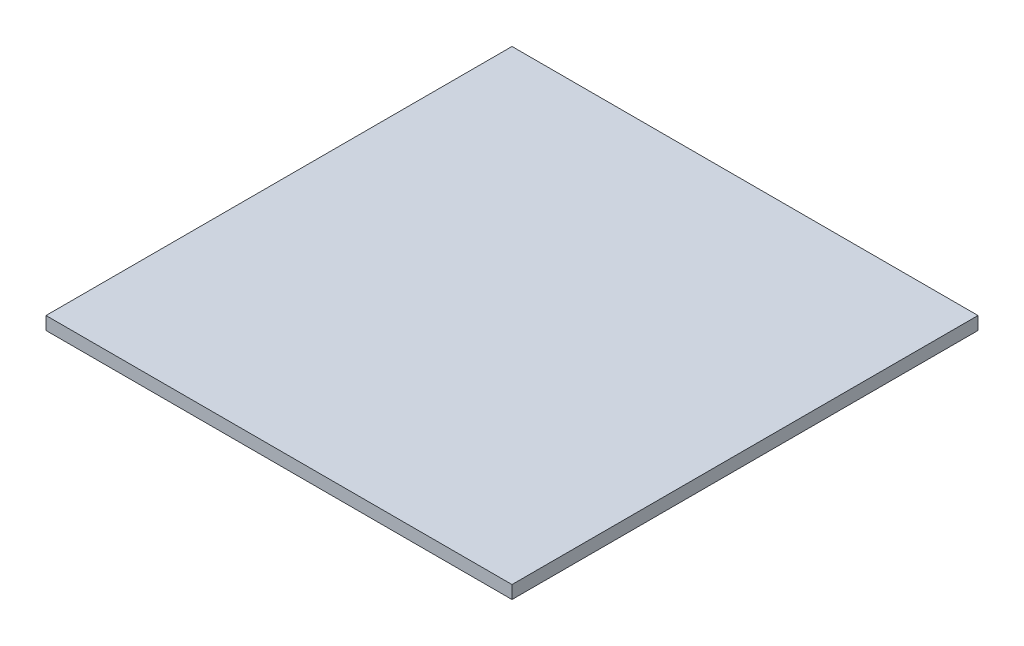
ISO-10303-21;
HEADER;
FILE_DESCRIPTION(('STEP AP214'),'2;1');
FILE_NAME('part.step','',(''),(''),'','','');
FILE_SCHEMA(('AUTOMOTIVE_DESIGN { 1 0 10303 214 1 1 1 1 }'));
ENDSEC;
DATA;
#1=APPLICATION_CONTEXT('core data for automotive mechanical design processes');
#2=APPLICATION_PROTOCOL_DEFINITION('international standard','automotive_design',2000,#1);
#3=PRODUCT_CONTEXT('',#1,'mechanical');
#4=PRODUCT('Part','Part','',(#3));
#5=PRODUCT_RELATED_PRODUCT_CATEGORY('part','',(#4));
#6=PRODUCT_DEFINITION_FORMATION('','',#4);
#7=PRODUCT_DEFINITION_CONTEXT('part definition',#1,'design');
#8=PRODUCT_DEFINITION('design','',#6,#7);
#9=PRODUCT_DEFINITION_SHAPE('','',#8);
#10=(LENGTH_UNIT() NAMED_UNIT(*) SI_UNIT(.MILLI.,.METRE.));
#11=(NAMED_UNIT(*) PLANE_ANGLE_UNIT() SI_UNIT($,.RADIAN.));
#12=(NAMED_UNIT(*) SI_UNIT($,.STERADIAN.) SOLID_ANGLE_UNIT());
#13=UNCERTAINTY_MEASURE_WITH_UNIT(LENGTH_MEASURE(1.E-05),#10,'distance_accuracy_value','');
#14=(GEOMETRIC_REPRESENTATION_CONTEXT(3) GLOBAL_UNCERTAINTY_ASSIGNED_CONTEXT((#13)) GLOBAL_UNIT_ASSIGNED_CONTEXT((#10,
#11,#12)) REPRESENTATION_CONTEXT('',''));
#15=CARTESIAN_POINT('',(0.,0.,0.));
#16=DIRECTION('',(0.,0.,1.));
#17=DIRECTION('',(1.,0.,0.));
#18=AXIS2_PLACEMENT_3D('',#15,#16,#17);
#19=CARTESIAN_POINT('',(33.5,6.,42.2484030110668));
#20=DIRECTION('',(0.,0.,-1.));
#21=DIRECTION('',(-1.,0.,0.));
#22=AXIS2_PLACEMENT_3D('',#19,#20,#21);
#23=PLANE('',#22);
#24=DIRECTION('',(1.,0.,0.));
#25=VECTOR('',#24,1.);
#26=CARTESIAN_POINT('',(33.5,0.,42.2484030110668));
#27=LINE('',#26,#25);
#28=CARTESIAN_POINT('',(-181.5,0.,42.2484030110668));
#29=VERTEX_POINT('',#28);
#30=CARTESIAN_POINT('',(33.5,0.,42.2484030110668));
#31=VERTEX_POINT('',#30);
#32=EDGE_CURVE('E108',#29,#31,#27,.T.);
#33=ORIENTED_EDGE('',*,*,#32,.T.);
#34=DIRECTION('',(0.,-1.,0.));
#35=VECTOR('',#34,1.);
#36=CARTESIAN_POINT('',(33.5,6.,42.2484030110668));
#37=LINE('',#36,#35);
#38=CARTESIAN_POINT('',(33.5,6.,42.2484030110668));
#39=VERTEX_POINT('',#38);
#40=EDGE_CURVE('E11',#39,#31,#37,.T.);
#41=ORIENTED_EDGE('',*,*,#40,.F.);
#42=DIRECTION('',(1.,0.,0.));
#43=VECTOR('',#42,1.);
#44=CARTESIAN_POINT('',(33.5,6.,42.2484030110668));
#45=LINE('',#44,#43);
#46=CARTESIAN_POINT('',(-181.5,6.,42.2484030110668));
#47=VERTEX_POINT('',#46);
#48=EDGE_CURVE('E92',#47,#39,#45,.T.);
#49=ORIENTED_EDGE('',*,*,#48,.F.);
#50=DIRECTION('',(0.,-1.,0.));
#51=VECTOR('',#50,1.);
#52=CARTESIAN_POINT('',(-181.5,6.,42.2484030110668));
#53=LINE('',#52,#51);
#54=EDGE_CURVE('E104',#47,#29,#53,.T.);
#55=ORIENTED_EDGE('',*,*,#54,.T.);
#56=EDGE_LOOP('',(#33,#41,#49,#55));
#57=FACE_BOUND('',#56,.T.);
#58=ADVANCED_FACE('F39',(#57),#23,.F.);
#59=CARTESIAN_POINT('',(33.5,6.,42.2484030110668));
#60=DIRECTION('',(-1.,0.,0.));
#61=DIRECTION('',(0.,0.,1.));
#62=AXIS2_PLACEMENT_3D('',#59,#60,#61);
#63=PLANE('',#62);
#64=DIRECTION('',(0.,0.,-1.));
#65=VECTOR('',#64,1.);
#66=CARTESIAN_POINT('',(33.5,0.,42.2484030110668));
#67=LINE('',#66,#65);
#68=CARTESIAN_POINT('',(33.5,0.,-172.751596988933));
#69=VERTEX_POINT('',#68);
#70=EDGE_CURVE('E97',#31,#69,#67,.T.);
#71=ORIENTED_EDGE('',*,*,#70,.T.);
#72=DIRECTION('',(0.,-1.,0.));
#73=VECTOR('',#72,1.);
#74=CARTESIAN_POINT('',(33.5,6.,-172.751596988933));
#75=LINE('',#74,#73);
#76=CARTESIAN_POINT('',(33.5,6.,-172.751596988933));
#77=VERTEX_POINT('',#76);
#78=EDGE_CURVE('E48',#77,#69,#75,.T.);
#79=ORIENTED_EDGE('',*,*,#78,.F.);
#80=DIRECTION('',(0.,0.,-1.));
#81=VECTOR('',#80,1.);
#82=CARTESIAN_POINT('',(33.5,6.,42.2484030110668));
#83=LINE('',#82,#81);
#84=EDGE_CURVE('E87',#39,#77,#83,.T.);
#85=ORIENTED_EDGE('',*,*,#84,.F.);
#86=ORIENTED_EDGE('',*,*,#40,.T.);
#87=EDGE_LOOP('',(#71,#79,#85,#86));
#88=FACE_BOUND('',#87,.T.);
#89=ADVANCED_FACE('F96',(#88),#63,.F.);
#90=CARTESIAN_POINT('',(33.5,6.,-172.751596988933));
#91=DIRECTION('',(0.,0.,1.));
#92=DIRECTION('',(1.,0.,0.));
#93=AXIS2_PLACEMENT_3D('',#90,#91,#92);
#94=PLANE('',#93);
#95=DIRECTION('',(-1.,0.,0.));
#96=VECTOR('',#95,1.);
#97=CARTESIAN_POINT('',(33.5,0.,-172.751596988933));
#98=LINE('',#97,#96);
#99=CARTESIAN_POINT('',(-181.5,0.,-172.751596988933));
#100=VERTEX_POINT('',#99);
#101=EDGE_CURVE('E73',#69,#100,#98,.T.);
#102=ORIENTED_EDGE('',*,*,#101,.T.);
#103=DIRECTION('',(0.,-1.,0.));
#104=VECTOR('',#103,1.);
#105=CARTESIAN_POINT('',(-181.5,6.,-172.751596988933));
#106=LINE('',#105,#104);
#107=CARTESIAN_POINT('',(-181.5,6.,-172.751596988933));
#108=VERTEX_POINT('',#107);
#109=EDGE_CURVE('E98',#108,#100,#106,.T.);
#110=ORIENTED_EDGE('',*,*,#109,.F.);
#111=DIRECTION('',(-1.,0.,0.));
#112=VECTOR('',#111,1.);
#113=CARTESIAN_POINT('',(33.5,6.,-172.751596988933));
#114=LINE('',#113,#112);
#115=EDGE_CURVE('E90',#77,#108,#114,.T.);
#116=ORIENTED_EDGE('',*,*,#115,.F.);
#117=ORIENTED_EDGE('',*,*,#78,.T.);
#118=EDGE_LOOP('',(#102,#110,#116,#117));
#119=FACE_BOUND('',#118,.T.);
#120=ADVANCED_FACE('F99',(#119),#94,.F.);
#121=CARTESIAN_POINT('',(-181.5,6.,42.2484030110668));
#122=DIRECTION('',(1.,0.,0.));
#123=DIRECTION('',(0.,0.,-1.));
#124=AXIS2_PLACEMENT_3D('',#121,#122,#123);
#125=PLANE('',#124);
#126=DIRECTION('',(0.,0.,1.));
#127=VECTOR('',#126,1.);
#128=CARTESIAN_POINT('',(-181.5,0.,42.2484030110668));
#129=LINE('',#128,#127);
#130=EDGE_CURVE('E79',#100,#29,#129,.T.);
#131=ORIENTED_EDGE('',*,*,#130,.T.);
#132=ORIENTED_EDGE('',*,*,#54,.F.);
#133=DIRECTION('',(0.,0.,1.));
#134=VECTOR('',#133,1.);
#135=CARTESIAN_POINT('',(-181.5,6.,42.2484030110668));
#136=LINE('',#135,#134);
#137=EDGE_CURVE('E56',#108,#47,#136,.T.);
#138=ORIENTED_EDGE('',*,*,#137,.F.);
#139=ORIENTED_EDGE('',*,*,#109,.T.);
#140=EDGE_LOOP('',(#131,#132,#138,#139));
#141=FACE_BOUND('',#140,.T.);
#142=ADVANCED_FACE('F117',(#141),#125,.F.);
#143=CARTESIAN_POINT('',(0.,6.,0.));
#144=DIRECTION('',(0.,-1.,0.));
#145=DIRECTION('',(0.,0.,-1.));
#146=AXIS2_PLACEMENT_3D('',#143,#144,#145);
#147=PLANE('',#146);
#148=ORIENTED_EDGE('',*,*,#48,.T.);
#149=ORIENTED_EDGE('',*,*,#84,.T.);
#150=ORIENTED_EDGE('',*,*,#115,.T.);
#151=ORIENTED_EDGE('',*,*,#137,.T.);
#152=EDGE_LOOP('',(#148,#149,#150,#151));
#153=FACE_BOUND('',#152,.T.);
#154=ADVANCED_FACE('F88',(#153),#147,.F.);
#155=CARTESIAN_POINT('',(0.,0.,0.));
#156=DIRECTION('',(0.,-1.,0.));
#157=DIRECTION('',(0.,0.,-1.));
#158=AXIS2_PLACEMENT_3D('',#155,#156,#157);
#159=PLANE('',#158);
#160=ORIENTED_EDGE('',*,*,#32,.F.);
#161=ORIENTED_EDGE('',*,*,#130,.F.);
#162=ORIENTED_EDGE('',*,*,#101,.F.);
#163=ORIENTED_EDGE('',*,*,#70,.F.);
#164=EDGE_LOOP('',(#160,#161,#162,#163));
#165=FACE_BOUND('',#164,.T.);
#166=ADVANCED_FACE('F120',(#165),#159,.T.);
#167=CLOSED_SHELL('',(#58,#89,#120,#142,#154,#166));
#168=MANIFOLD_SOLID_BREP('B2',#167);
#169=ADVANCED_BREP_SHAPE_REPRESENTATION('',(#18,#168),#14);
#170=SHAPE_DEFINITION_REPRESENTATION(#9,#169);
ENDSEC;
END-ISO-10303-21;
